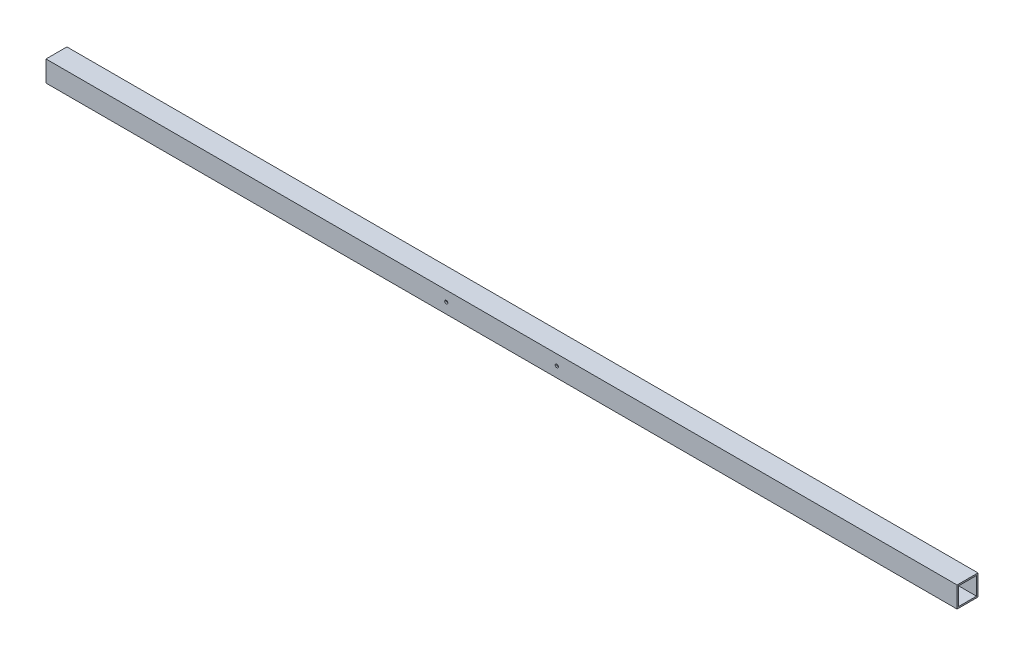
ISO-10303-21;
HEADER;
FILE_DESCRIPTION(('STEP AP214'),'2;1');
FILE_NAME('part.step','',(''),(''),'','','');
FILE_SCHEMA(('AUTOMOTIVE_DESIGN { 1 0 10303 214 1 1 1 1 }'));
ENDSEC;
DATA;
#1=APPLICATION_CONTEXT('core data for automotive mechanical design processes');
#2=APPLICATION_PROTOCOL_DEFINITION('international standard','automotive_design',2000,#1);
#3=PRODUCT_CONTEXT('',#1,'mechanical');
#4=PRODUCT('Part','Part','',(#3));
#5=PRODUCT_RELATED_PRODUCT_CATEGORY('part','',(#4));
#6=PRODUCT_DEFINITION_FORMATION('','',#4);
#7=PRODUCT_DEFINITION_CONTEXT('part definition',#1,'design');
#8=PRODUCT_DEFINITION('design','',#6,#7);
#9=PRODUCT_DEFINITION_SHAPE('','',#8);
#10=(LENGTH_UNIT() NAMED_UNIT(*) SI_UNIT(.MILLI.,.METRE.));
#11=(NAMED_UNIT(*) PLANE_ANGLE_UNIT() SI_UNIT($,.RADIAN.));
#12=(NAMED_UNIT(*) SI_UNIT($,.STERADIAN.) SOLID_ANGLE_UNIT());
#13=UNCERTAINTY_MEASURE_WITH_UNIT(LENGTH_MEASURE(1.E-05),#10,'distance_accuracy_value','');
#14=(GEOMETRIC_REPRESENTATION_CONTEXT(3) GLOBAL_UNCERTAINTY_ASSIGNED_CONTEXT((#13)) GLOBAL_UNIT_ASSIGNED_CONTEXT((#10,
#11,#12)) REPRESENTATION_CONTEXT('',''));
#15=CARTESIAN_POINT('',(0.,0.,0.));
#16=DIRECTION('',(0.,0.,1.));
#17=DIRECTION('',(1.,0.,0.));
#18=AXIS2_PLACEMENT_3D('',#15,#16,#17);
#19=CARTESIAN_POINT('',(1936.75,0.,0.));
#20=DIRECTION('',(-1.,0.,0.));
#21=DIRECTION('',(0.,0.,1.));
#22=AXIS2_PLACEMENT_3D('',#19,#20,#21);
#23=PLANE('',#22);
#24=DIRECTION('',(0.,-1.,0.));
#25=VECTOR('',#24,1.);
#26=CARTESIAN_POINT('',(1936.75,0.,0.));
#27=LINE('',#26,#25);
#28=CARTESIAN_POINT('',(1936.75,44.45,0.));
#29=VERTEX_POINT('',#28);
#30=CARTESIAN_POINT('',(1936.75,0.,0.));
#31=VERTEX_POINT('',#30);
#32=EDGE_CURVE('E139',#29,#31,#27,.T.);
#33=ORIENTED_EDGE('',*,*,#32,.T.);
#34=DIRECTION('',(0.,0.,-1.));
#35=VECTOR('',#34,1.);
#36=CARTESIAN_POINT('',(1936.75,0.,0.));
#37=LINE('',#36,#35);
#38=CARTESIAN_POINT('',(1936.75,0.,-44.45));
#39=VERTEX_POINT('',#38);
#40=EDGE_CURVE('E142',#31,#39,#37,.T.);
#41=ORIENTED_EDGE('',*,*,#40,.T.);
#42=DIRECTION('',(0.,1.,0.));
#43=VECTOR('',#42,1.);
#44=CARTESIAN_POINT('',(1936.75,0.,-44.45));
#45=LINE('',#44,#43);
#46=CARTESIAN_POINT('',(1936.75,44.45,-44.45));
#47=VERTEX_POINT('',#46);
#48=EDGE_CURVE('E145',#39,#47,#45,.T.);
#49=ORIENTED_EDGE('',*,*,#48,.T.);
#50=DIRECTION('',(0.,0.,1.));
#51=VECTOR('',#50,1.);
#52=CARTESIAN_POINT('',(1936.75,44.45,0.));
#53=LINE('',#52,#51);
#54=EDGE_CURVE('E147',#47,#29,#53,.T.);
#55=ORIENTED_EDGE('',*,*,#54,.T.);
#56=EDGE_LOOP('',(#33,#41,#49,#55));
#57=FACE_BOUND('',#56,.T.);
#58=DIRECTION('',(0.,-1.,0.));
#59=VECTOR('',#58,1.);
#60=CARTESIAN_POINT('',(1936.75,41.275,-3.175));
#61=LINE('',#60,#59);
#62=CARTESIAN_POINT('',(1936.75,41.275,-3.175));
#63=VERTEX_POINT('',#62);
#64=CARTESIAN_POINT('',(1936.75,3.175,-3.175));
#65=VERTEX_POINT('',#64);
#66=EDGE_CURVE('E101',#63,#65,#61,.T.);
#67=ORIENTED_EDGE('',*,*,#66,.F.);
#68=DIRECTION('',(0.,0.,1.));
#69=VECTOR('',#68,1.);
#70=CARTESIAN_POINT('',(1936.75,41.275,-3.175));
#71=LINE('',#70,#69);
#72=CARTESIAN_POINT('',(1936.75,41.275,-41.275));
#73=VERTEX_POINT('',#72);
#74=EDGE_CURVE('E123',#73,#63,#71,.T.);
#75=ORIENTED_EDGE('',*,*,#74,.F.);
#76=DIRECTION('',(0.,1.,0.));
#77=VECTOR('',#76,1.);
#78=CARTESIAN_POINT('',(1936.75,41.275,-41.275));
#79=LINE('',#78,#77);
#80=CARTESIAN_POINT('',(1936.75,3.175,-41.275));
#81=VERTEX_POINT('',#80);
#82=EDGE_CURVE('E121',#81,#73,#79,.T.);
#83=ORIENTED_EDGE('',*,*,#82,.F.);
#84=DIRECTION('',(0.,0.,-1.));
#85=VECTOR('',#84,1.);
#86=CARTESIAN_POINT('',(1936.75,3.175,-3.175));
#87=LINE('',#86,#85);
#88=EDGE_CURVE('E109',#65,#81,#87,.T.);
#89=ORIENTED_EDGE('',*,*,#88,.F.);
#90=EDGE_LOOP('',(#67,#75,#83,#89));
#91=FACE_BOUND('',#90,.T.);
#92=ADVANCED_FACE('F34',(#57,#91),#23,.F.);
#93=CARTESIAN_POINT('',(0.,0.,0.));
#94=DIRECTION('',(-1.,0.,0.));
#95=DIRECTION('',(0.,0.,1.));
#96=AXIS2_PLACEMENT_3D('',#93,#94,#95);
#97=PLANE('',#96);
#98=DIRECTION('',(0.,-1.,0.));
#99=VECTOR('',#98,1.);
#100=CARTESIAN_POINT('',(0.,0.,0.));
#101=LINE('',#100,#99);
#102=CARTESIAN_POINT('',(0.,44.45,0.));
#103=VERTEX_POINT('',#102);
#104=CARTESIAN_POINT('',(0.,0.,0.));
#105=VERTEX_POINT('',#104);
#106=EDGE_CURVE('E117',#103,#105,#101,.T.);
#107=ORIENTED_EDGE('',*,*,#106,.F.);
#108=DIRECTION('',(0.,0.,1.));
#109=VECTOR('',#108,1.);
#110=CARTESIAN_POINT('',(0.,44.45,0.));
#111=LINE('',#110,#109);
#112=CARTESIAN_POINT('',(0.,44.45,-44.45));
#113=VERTEX_POINT('',#112);
#114=EDGE_CURVE('E143',#113,#103,#111,.T.);
#115=ORIENTED_EDGE('',*,*,#114,.F.);
#116=DIRECTION('',(0.,1.,0.));
#117=VECTOR('',#116,1.);
#118=CARTESIAN_POINT('',(0.,0.,-44.45));
#119=LINE('',#118,#117);
#120=CARTESIAN_POINT('',(0.,0.,-44.45));
#121=VERTEX_POINT('',#120);
#122=EDGE_CURVE('E154',#121,#113,#119,.T.);
#123=ORIENTED_EDGE('',*,*,#122,.F.);
#124=DIRECTION('',(0.,0.,-1.));
#125=VECTOR('',#124,1.);
#126=CARTESIAN_POINT('',(0.,0.,0.));
#127=LINE('',#126,#125);
#128=EDGE_CURVE('E152',#105,#121,#127,.T.);
#129=ORIENTED_EDGE('',*,*,#128,.F.);
#130=EDGE_LOOP('',(#107,#115,#123,#129));
#131=FACE_BOUND('',#130,.T.);
#132=DIRECTION('',(0.,0.,1.));
#133=VECTOR('',#132,1.);
#134=CARTESIAN_POINT('',(0.,41.275,-3.175));
#135=LINE('',#134,#133);
#136=CARTESIAN_POINT('',(0.,41.275,-41.275));
#137=VERTEX_POINT('',#136);
#138=CARTESIAN_POINT('',(0.,41.275,-3.175));
#139=VERTEX_POINT('',#138);
#140=EDGE_CURVE('E110',#137,#139,#135,.T.);
#141=ORIENTED_EDGE('',*,*,#140,.T.);
#142=DIRECTION('',(0.,-1.,0.));
#143=VECTOR('',#142,1.);
#144=CARTESIAN_POINT('',(0.,41.275,-3.175));
#145=LINE('',#144,#143);
#146=CARTESIAN_POINT('',(0.,3.175,-3.175));
#147=VERTEX_POINT('',#146);
#148=EDGE_CURVE('E59',#139,#147,#145,.T.);
#149=ORIENTED_EDGE('',*,*,#148,.T.);
#150=DIRECTION('',(0.,0.,-1.));
#151=VECTOR('',#150,1.);
#152=CARTESIAN_POINT('',(0.,3.175,-3.175));
#153=LINE('',#152,#151);
#154=CARTESIAN_POINT('',(0.,3.175,-41.275));
#155=VERTEX_POINT('',#154);
#156=EDGE_CURVE('E116',#147,#155,#153,.T.);
#157=ORIENTED_EDGE('',*,*,#156,.T.);
#158=DIRECTION('',(0.,1.,0.));
#159=VECTOR('',#158,1.);
#160=CARTESIAN_POINT('',(0.,41.275,-41.275));
#161=LINE('',#160,#159);
#162=EDGE_CURVE('E131',#155,#137,#161,.T.);
#163=ORIENTED_EDGE('',*,*,#162,.T.);
#164=EDGE_LOOP('',(#141,#149,#157,#163));
#165=FACE_BOUND('',#164,.T.);
#166=ADVANCED_FACE('F192',(#131,#165),#97,.T.);
#167=CARTESIAN_POINT('',(1936.75,0.,0.));
#168=DIRECTION('',(0.,0.,-1.));
#169=DIRECTION('',(-1.,0.,0.));
#170=AXIS2_PLACEMENT_3D('',#167,#168,#169);
#171=PLANE('',#170);
#172=CARTESIAN_POINT('',(850.9,22.2249999999998,0.));
#173=DIRECTION('',(0.,0.,1.));
#174=DIRECTION('',(1.,0.,0.));
#175=AXIS2_PLACEMENT_3D('',#172,#173,#174);
#176=CIRCLE('',#175,3.373501);
#177=CARTESIAN_POINT('',(854.273501,22.2249999999998,0.));
#178=VERTEX_POINT('',#177);
#179=EDGE_CURVE('E183',#178,#178,#176,.T.);
#180=ORIENTED_EDGE('',*,*,#179,.F.);
#181=EDGE_LOOP('',(#180));
#182=FACE_BOUND('',#181,.T.);
#183=CARTESIAN_POINT('',(1085.85,22.2249999999998,0.));
#184=DIRECTION('',(0.,0.,1.));
#185=DIRECTION('',(1.,0.,0.));
#186=AXIS2_PLACEMENT_3D('',#183,#184,#185);
#187=CIRCLE('',#186,3.373501);
#188=CARTESIAN_POINT('',(1089.223501,22.2249999999998,0.));
#189=VERTEX_POINT('',#188);
#190=EDGE_CURVE('E170',#189,#189,#187,.T.);
#191=ORIENTED_EDGE('',*,*,#190,.F.);
#192=EDGE_LOOP('',(#191));
#193=FACE_BOUND('',#192,.T.);
#194=ORIENTED_EDGE('',*,*,#106,.T.);
#195=DIRECTION('',(-1.,0.,0.));
#196=VECTOR('',#195,1.);
#197=CARTESIAN_POINT('',(1936.75,0.,0.));
#198=LINE('',#197,#196);
#199=EDGE_CURVE('E11',#31,#105,#198,.T.);
#200=ORIENTED_EDGE('',*,*,#199,.F.);
#201=ORIENTED_EDGE('',*,*,#32,.F.);
#202=DIRECTION('',(-1.,0.,0.));
#203=VECTOR('',#202,1.);
#204=CARTESIAN_POINT('',(1936.75,44.45,0.));
#205=LINE('',#204,#203);
#206=EDGE_CURVE('E149',#29,#103,#205,.T.);
#207=ORIENTED_EDGE('',*,*,#206,.T.);
#208=EDGE_LOOP('',(#194,#200,#201,#207));
#209=FACE_BOUND('',#208,.T.);
#210=ADVANCED_FACE('F36',(#182,#193,#209),#171,.F.);
#211=CARTESIAN_POINT('',(1936.75,0.,0.));
#212=DIRECTION('',(0.,1.,0.));
#213=DIRECTION('',(0.,0.,1.));
#214=AXIS2_PLACEMENT_3D('',#211,#212,#213);
#215=PLANE('',#214);
#216=ORIENTED_EDGE('',*,*,#128,.T.);
#217=DIRECTION('',(-1.,0.,0.));
#218=VECTOR('',#217,1.);
#219=CARTESIAN_POINT('',(1936.75,0.,-44.45));
#220=LINE('',#219,#218);
#221=EDGE_CURVE('E43',#39,#121,#220,.T.);
#222=ORIENTED_EDGE('',*,*,#221,.F.);
#223=ORIENTED_EDGE('',*,*,#40,.F.);
#224=ORIENTED_EDGE('',*,*,#199,.T.);
#225=EDGE_LOOP('',(#216,#222,#223,#224));
#226=FACE_BOUND('',#225,.T.);
#227=ADVANCED_FACE('F191',(#226),#215,.F.);
#228=CARTESIAN_POINT('',(1936.75,0.,-44.45));
#229=DIRECTION('',(0.,0.,1.));
#230=DIRECTION('',(1.,0.,0.));
#231=AXIS2_PLACEMENT_3D('',#228,#229,#230);
#232=PLANE('',#231);
#233=CARTESIAN_POINT('',(850.9,22.2249999999998,-44.45));
#234=DIRECTION('',(0.,0.,1.));
#235=DIRECTION('',(1.,0.,0.));
#236=AXIS2_PLACEMENT_3D('',#233,#234,#235);
#237=CIRCLE('',#236,3.373501);
#238=CARTESIAN_POINT('',(854.273501,22.2249999999998,-44.45));
#239=VERTEX_POINT('',#238);
#240=EDGE_CURVE('E180',#239,#239,#237,.T.);
#241=ORIENTED_EDGE('',*,*,#240,.T.);
#242=EDGE_LOOP('',(#241));
#243=FACE_BOUND('',#242,.T.);
#244=CARTESIAN_POINT('',(1085.85,22.2249999999998,-44.45));
#245=DIRECTION('',(0.,0.,1.));
#246=DIRECTION('',(1.,0.,0.));
#247=AXIS2_PLACEMENT_3D('',#244,#245,#246);
#248=CIRCLE('',#247,3.373501);
#249=CARTESIAN_POINT('',(1089.223501,22.2249999999998,-44.45));
#250=VERTEX_POINT('',#249);
#251=EDGE_CURVE('E165',#250,#250,#248,.T.);
#252=ORIENTED_EDGE('',*,*,#251,.T.);
#253=EDGE_LOOP('',(#252));
#254=FACE_BOUND('',#253,.T.);
#255=ORIENTED_EDGE('',*,*,#122,.T.);
#256=DIRECTION('',(-1.,0.,0.));
#257=VECTOR('',#256,1.);
#258=CARTESIAN_POINT('',(1936.75,44.45,-44.45));
#259=LINE('',#258,#257);
#260=EDGE_CURVE('E159',#47,#113,#259,.T.);
#261=ORIENTED_EDGE('',*,*,#260,.F.);
#262=ORIENTED_EDGE('',*,*,#48,.F.);
#263=ORIENTED_EDGE('',*,*,#221,.T.);
#264=EDGE_LOOP('',(#255,#261,#262,#263));
#265=FACE_BOUND('',#264,.T.);
#266=ADVANCED_FACE('F212',(#243,#254,#265),#232,.F.);
#267=CARTESIAN_POINT('',(1936.75,44.45,0.));
#268=DIRECTION('',(0.,-1.,0.));
#269=DIRECTION('',(0.,0.,-1.));
#270=AXIS2_PLACEMENT_3D('',#267,#268,#269);
#271=PLANE('',#270);
#272=ORIENTED_EDGE('',*,*,#114,.T.);
#273=ORIENTED_EDGE('',*,*,#206,.F.);
#274=ORIENTED_EDGE('',*,*,#54,.F.);
#275=ORIENTED_EDGE('',*,*,#260,.T.);
#276=EDGE_LOOP('',(#272,#273,#274,#275));
#277=FACE_BOUND('',#276,.T.);
#278=ADVANCED_FACE('F210',(#277),#271,.F.);
#279=CARTESIAN_POINT('',(1936.75,41.275,-3.175));
#280=DIRECTION('',(0.,0.,-1.));
#281=DIRECTION('',(0.,1.,0.));
#282=AXIS2_PLACEMENT_3D('',#279,#280,#281);
#283=PLANE('',#282);
#284=CARTESIAN_POINT('',(850.9,22.2249999999998,-3.175));
#285=DIRECTION('',(0.,0.,-1.));
#286=DIRECTION('',(0.,1.,0.));
#287=AXIS2_PLACEMENT_3D('',#284,#285,#286);
#288=CIRCLE('',#287,3.373501);
#289=CARTESIAN_POINT('',(850.9,25.5985009999998,-3.175));
#290=VERTEX_POINT('',#289);
#291=EDGE_CURVE('E38',#290,#290,#288,.T.);
#292=ORIENTED_EDGE('',*,*,#291,.F.);
#293=EDGE_LOOP('',(#292));
#294=FACE_BOUND('',#293,.T.);
#295=CARTESIAN_POINT('',(1085.85,22.2249999999998,-3.175));
#296=DIRECTION('',(0.,0.,-1.));
#297=DIRECTION('',(0.,1.,0.));
#298=AXIS2_PLACEMENT_3D('',#295,#296,#297);
#299=CIRCLE('',#298,3.373501);
#300=CARTESIAN_POINT('',(1085.85,25.5985009999998,-3.175));
#301=VERTEX_POINT('',#300);
#302=EDGE_CURVE('E129',#301,#301,#299,.T.);
#303=ORIENTED_EDGE('',*,*,#302,.F.);
#304=EDGE_LOOP('',(#303));
#305=FACE_BOUND('',#304,.T.);
#306=ORIENTED_EDGE('',*,*,#148,.F.);
#307=DIRECTION('',(-1.,0.,0.));
#308=VECTOR('',#307,1.);
#309=CARTESIAN_POINT('',(1936.75,41.275,-3.175));
#310=LINE('',#309,#308);
#311=EDGE_CURVE('E105',#63,#139,#310,.T.);
#312=ORIENTED_EDGE('',*,*,#311,.F.);
#313=ORIENTED_EDGE('',*,*,#66,.T.);
#314=DIRECTION('',(-1.,0.,0.));
#315=VECTOR('',#314,1.);
#316=CARTESIAN_POINT('',(1936.75,3.175,-3.175));
#317=LINE('',#316,#315);
#318=EDGE_CURVE('E104',#65,#147,#317,.T.);
#319=ORIENTED_EDGE('',*,*,#318,.T.);
#320=EDGE_LOOP('',(#306,#312,#313,#319));
#321=FACE_BOUND('',#320,.T.);
#322=ADVANCED_FACE('F103',(#294,#305,#321),#283,.T.);
#323=CARTESIAN_POINT('',(1936.75,3.175,-3.175));
#324=DIRECTION('',(0.,1.,0.));
#325=DIRECTION('',(0.,0.,1.));
#326=AXIS2_PLACEMENT_3D('',#323,#324,#325);
#327=PLANE('',#326);
#328=ORIENTED_EDGE('',*,*,#156,.F.);
#329=ORIENTED_EDGE('',*,*,#318,.F.);
#330=ORIENTED_EDGE('',*,*,#88,.T.);
#331=DIRECTION('',(-1.,0.,0.));
#332=VECTOR('',#331,1.);
#333=CARTESIAN_POINT('',(1936.75,3.175,-41.275));
#334=LINE('',#333,#332);
#335=EDGE_CURVE('E118',#81,#155,#334,.T.);
#336=ORIENTED_EDGE('',*,*,#335,.T.);
#337=EDGE_LOOP('',(#328,#329,#330,#336));
#338=FACE_BOUND('',#337,.T.);
#339=ADVANCED_FACE('F113',(#338),#327,.T.);
#340=CARTESIAN_POINT('',(1936.75,41.275,-41.275));
#341=DIRECTION('',(0.,0.,1.));
#342=DIRECTION('',(0.,-1.,0.));
#343=AXIS2_PLACEMENT_3D('',#340,#341,#342);
#344=PLANE('',#343);
#345=CARTESIAN_POINT('',(850.9,22.2249999999998,-41.275));
#346=DIRECTION('',(0.,0.,1.));
#347=DIRECTION('',(0.,-1.,0.));
#348=AXIS2_PLACEMENT_3D('',#345,#346,#347);
#349=CIRCLE('',#348,3.373501);
#350=CARTESIAN_POINT('',(850.9,18.8514989999998,-41.275));
#351=VERTEX_POINT('',#350);
#352=EDGE_CURVE('E175',#351,#351,#349,.T.);
#353=ORIENTED_EDGE('',*,*,#352,.F.);
#354=EDGE_LOOP('',(#353));
#355=FACE_BOUND('',#354,.T.);
#356=CARTESIAN_POINT('',(1085.85,22.2249999999998,-41.275));
#357=DIRECTION('',(0.,0.,1.));
#358=DIRECTION('',(0.,-1.,0.));
#359=AXIS2_PLACEMENT_3D('',#356,#357,#358);
#360=CIRCLE('',#359,3.373501);
#361=CARTESIAN_POINT('',(1085.85,18.8514989999998,-41.275));
#362=VERTEX_POINT('',#361);
#363=EDGE_CURVE('E163',#362,#362,#360,.T.);
#364=ORIENTED_EDGE('',*,*,#363,.F.);
#365=EDGE_LOOP('',(#364));
#366=FACE_BOUND('',#365,.T.);
#367=ORIENTED_EDGE('',*,*,#162,.F.);
#368=ORIENTED_EDGE('',*,*,#335,.F.);
#369=ORIENTED_EDGE('',*,*,#82,.T.);
#370=DIRECTION('',(-1.,0.,0.));
#371=VECTOR('',#370,1.);
#372=CARTESIAN_POINT('',(1936.75,41.275,-41.275));
#373=LINE('',#372,#371);
#374=EDGE_CURVE('E51',#73,#137,#373,.T.);
#375=ORIENTED_EDGE('',*,*,#374,.T.);
#376=EDGE_LOOP('',(#367,#368,#369,#375));
#377=FACE_BOUND('',#376,.T.);
#378=ADVANCED_FACE('F233',(#355,#366,#377),#344,.T.);
#379=CARTESIAN_POINT('',(1936.75,41.275,-3.175));
#380=DIRECTION('',(0.,-1.,0.));
#381=DIRECTION('',(0.,0.,-1.));
#382=AXIS2_PLACEMENT_3D('',#379,#380,#381);
#383=PLANE('',#382);
#384=ORIENTED_EDGE('',*,*,#140,.F.);
#385=ORIENTED_EDGE('',*,*,#374,.F.);
#386=ORIENTED_EDGE('',*,*,#74,.T.);
#387=ORIENTED_EDGE('',*,*,#311,.T.);
#388=EDGE_LOOP('',(#384,#385,#386,#387));
#389=FACE_BOUND('',#388,.T.);
#390=ADVANCED_FACE('F236',(#389),#383,.T.);
#391=CARTESIAN_POINT('',(1085.85,22.2249999999998,0.));
#392=DIRECTION('',(0.,0.,1.));
#393=DIRECTION('',(1.,0.,0.));
#394=AXIS2_PLACEMENT_3D('',#391,#392,#393);
#395=CYLINDRICAL_SURFACE('',#394,3.373501);
#396=ORIENTED_EDGE('',*,*,#363,.T.);
#397=EDGE_LOOP('',(#396));
#398=FACE_BOUND('',#397,.T.);
#399=ORIENTED_EDGE('',*,*,#251,.F.);
#400=EDGE_LOOP('',(#399));
#401=FACE_BOUND('',#400,.T.);
#402=ADVANCED_FACE('F240',(#398,#401),#395,.F.);
#403=ORIENTED_EDGE('',*,*,#302,.T.);
#404=EDGE_LOOP('',(#403));
#405=FACE_BOUND('',#404,.T.);
#406=ORIENTED_EDGE('',*,*,#190,.T.);
#407=EDGE_LOOP('',(#406));
#408=FACE_BOUND('',#407,.T.);
#409=ADVANCED_FACE('F243',(#405,#408),#395,.F.);
#410=CARTESIAN_POINT('',(850.9,22.2249999999998,0.));
#411=DIRECTION('',(0.,0.,1.));
#412=DIRECTION('',(1.,0.,0.));
#413=AXIS2_PLACEMENT_3D('',#410,#411,#412);
#414=CYLINDRICAL_SURFACE('',#413,3.373501);
#415=ORIENTED_EDGE('',*,*,#291,.T.);
#416=EDGE_LOOP('',(#415));
#417=FACE_BOUND('',#416,.T.);
#418=ORIENTED_EDGE('',*,*,#179,.T.);
#419=EDGE_LOOP('',(#418));
#420=FACE_BOUND('',#419,.T.);
#421=ADVANCED_FACE('F187',(#417,#420),#414,.F.);
#422=ORIENTED_EDGE('',*,*,#352,.T.);
#423=EDGE_LOOP('',(#422));
#424=FACE_BOUND('',#423,.T.);
#425=ORIENTED_EDGE('',*,*,#240,.F.);
#426=EDGE_LOOP('',(#425));
#427=FACE_BOUND('',#426,.T.);
#428=ADVANCED_FACE('F245',(#424,#427),#414,.F.);
#429=CLOSED_SHELL('',(#92,#166,#210,#227,#266,#278,#322,#339,#378,#390,#402,#409,#421,#428));
#430=MANIFOLD_SOLID_BREP('B2',#429);
#431=ADVANCED_BREP_SHAPE_REPRESENTATION('',(#18,#430),#14);
#432=SHAPE_DEFINITION_REPRESENTATION(#9,#431);
ENDSEC;
END-ISO-10303-21;
